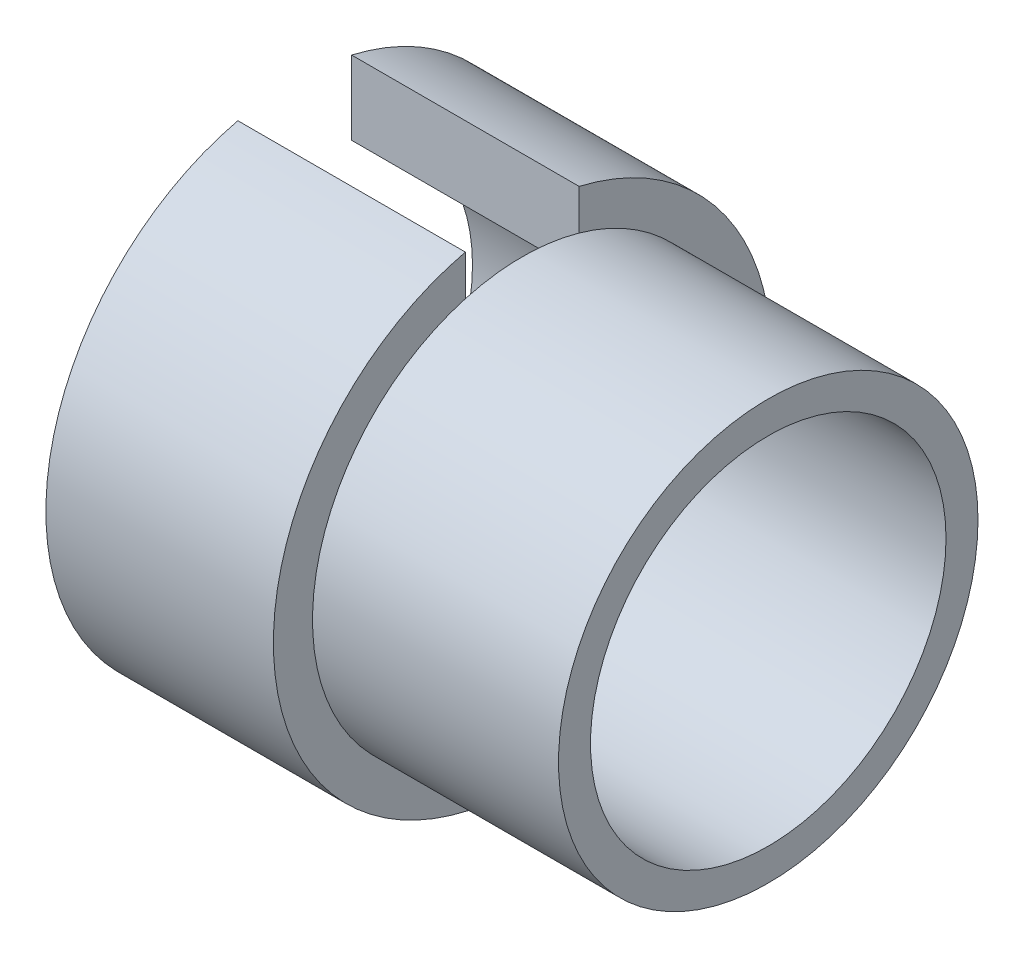
ISO-10303-21;
HEADER;
FILE_DESCRIPTION(('STEP AP214'),'2;1');
FILE_NAME('part.step','',(''),(''),'','','');
FILE_SCHEMA(('AUTOMOTIVE_DESIGN { 1 0 10303 214 1 1 1 1 }'));
ENDSEC;
DATA;
#1=APPLICATION_CONTEXT('core data for automotive mechanical design processes');
#2=APPLICATION_PROTOCOL_DEFINITION('international standard','automotive_design',2000,#1);
#3=PRODUCT_CONTEXT('',#1,'mechanical');
#4=PRODUCT('Part','Part','',(#3));
#5=PRODUCT_RELATED_PRODUCT_CATEGORY('part','',(#4));
#6=PRODUCT_DEFINITION_FORMATION('','',#4);
#7=PRODUCT_DEFINITION_CONTEXT('part definition',#1,'design');
#8=PRODUCT_DEFINITION('design','',#6,#7);
#9=PRODUCT_DEFINITION_SHAPE('','',#8);
#10=(LENGTH_UNIT() NAMED_UNIT(*) SI_UNIT(.MILLI.,.METRE.));
#11=(NAMED_UNIT(*) PLANE_ANGLE_UNIT() SI_UNIT($,.RADIAN.));
#12=(NAMED_UNIT(*) SI_UNIT($,.STERADIAN.) SOLID_ANGLE_UNIT());
#13=UNCERTAINTY_MEASURE_WITH_UNIT(LENGTH_MEASURE(1.E-05),#10,'distance_accuracy_value','');
#14=(GEOMETRIC_REPRESENTATION_CONTEXT(3) GLOBAL_UNCERTAINTY_ASSIGNED_CONTEXT((#13)) GLOBAL_UNIT_ASSIGNED_CONTEXT((#10,
#11,#12)) REPRESENTATION_CONTEXT('',''));
#15=CARTESIAN_POINT('',(0.,0.,0.));
#16=DIRECTION('',(0.,0.,1.));
#17=DIRECTION('',(1.,0.,0.));
#18=AXIS2_PLACEMENT_3D('',#15,#16,#17);
#19=CARTESIAN_POINT('',(-122.602643770449,-155.807573628499,0.));
#20=DIRECTION('',(1.,0.,0.));
#21=DIRECTION('',(0.,0.,-1.));
#22=AXIS2_PLACEMENT_3D('',#19,#20,#21);
#23=CYLINDRICAL_SURFACE('',#22,14.7500000000002);
#24=CARTESIAN_POINT('',(-133.35,-155.807573628499,0.));
#25=DIRECTION('',(1.,0.,0.));
#26=DIRECTION('',(0.,0.,-1.));
#27=AXIS2_PLACEMENT_3D('',#24,#25,#26);
#28=CIRCLE('',#27,14.7500000000002);
#29=CARTESIAN_POINT('',(-133.35,-141.610302763998,-4.));
#30=VERTEX_POINT('',#29);
#31=CARTESIAN_POINT('',(-133.35,-141.610302763998,4.));
#32=VERTEX_POINT('',#31);
#33=EDGE_CURVE('E104',#30,#32,#28,.T.);
#34=ORIENTED_EDGE('',*,*,#33,.T.);
#35=EDGE_CURVE('E124',#32,#30,#28,.T.);
#36=ORIENTED_EDGE('',*,*,#35,.T.);
#37=EDGE_LOOP('',(#34,#36));
#38=FACE_BOUND('',#37,.T.);
#39=CARTESIAN_POINT('',(-116.05,-155.807573628499,0.));
#40=DIRECTION('',(1.,0.,0.));
#41=DIRECTION('',(0.,0.,-1.));
#42=AXIS2_PLACEMENT_3D('',#39,#40,#41);
#43=CIRCLE('',#42,14.7500000000002);
#44=CARTESIAN_POINT('',(-116.05,-155.807573628499,-14.7500000000002));
#45=VERTEX_POINT('',#44);
#46=EDGE_CURVE('E41',#45,#45,#43,.T.);
#47=ORIENTED_EDGE('',*,*,#46,.F.);
#48=EDGE_LOOP('',(#47));
#49=FACE_BOUND('',#48,.T.);
#50=ADVANCED_FACE('F34',(#38,#49),#23,.T.);
#51=CARTESIAN_POINT('',(-116.05,-141.057573628498,0.));
#52=DIRECTION('',(1.,0.,0.));
#53=DIRECTION('',(0.,0.,-1.));
#54=AXIS2_PLACEMENT_3D('',#51,#52,#53);
#55=PLANE('',#54);
#56=ORIENTED_EDGE('',*,*,#46,.T.);
#57=EDGE_LOOP('',(#56));
#58=FACE_BOUND('',#57,.T.);
#59=CARTESIAN_POINT('',(-116.05,-155.807573628499,0.));
#60=DIRECTION('',(1.,0.,0.));
#61=DIRECTION('',(0.,0.,-1.));
#62=AXIS2_PLACEMENT_3D('',#59,#60,#61);
#63=CIRCLE('',#62,12.5);
#64=CARTESIAN_POINT('',(-116.05,-155.807573628499,-12.5));
#65=VERTEX_POINT('',#64);
#66=EDGE_CURVE('E102',#65,#65,#63,.T.);
#67=ORIENTED_EDGE('',*,*,#66,.F.);
#68=EDGE_LOOP('',(#67));
#69=FACE_BOUND('',#68,.T.);
#70=ADVANCED_FACE('F112',(#58,#69),#55,.T.);
#71=CARTESIAN_POINT('',(-122.602643770449,-155.807573628499,0.));
#72=DIRECTION('',(1.,0.,0.));
#73=DIRECTION('',(0.,0.,-1.));
#74=AXIS2_PLACEMENT_3D('',#71,#72,#73);
#75=CYLINDRICAL_SURFACE('',#74,12.5);
#76=DIRECTION('',(1.,0.,0.));
#77=VECTOR('',#76,1.);
#78=CARTESIAN_POINT('',(-122.602643770449,-143.964854346172,-4.));
#79=LINE('',#78,#77);
#80=CARTESIAN_POINT('',(-149.35,-143.964854346172,-4.));
#81=VERTEX_POINT('',#80);
#82=CARTESIAN_POINT('',(-133.35,-143.964854346172,-4.));
#83=VERTEX_POINT('',#82);
#84=EDGE_CURVE('E132',#81,#83,#79,.T.);
#85=ORIENTED_EDGE('',*,*,#84,.F.);
#86=CARTESIAN_POINT('',(-149.35,-155.807573628499,0.));
#87=DIRECTION('',(1.,0.,0.));
#88=DIRECTION('',(0.,0.,-1.));
#89=AXIS2_PLACEMENT_3D('',#86,#87,#88);
#90=CIRCLE('',#89,12.5);
#91=CARTESIAN_POINT('',(-149.35,-143.964854346172,4.));
#92=VERTEX_POINT('',#91);
#93=EDGE_CURVE('E100',#92,#81,#90,.T.);
#94=ORIENTED_EDGE('',*,*,#93,.F.);
#95=DIRECTION('',(1.,0.,0.));
#96=VECTOR('',#95,1.);
#97=CARTESIAN_POINT('',(-122.602643770449,-143.964854346172,4.));
#98=LINE('',#97,#96);
#99=CARTESIAN_POINT('',(-133.35,-143.964854346172,4.));
#100=VERTEX_POINT('',#99);
#101=EDGE_CURVE('E81',#100,#92,#98,.F.);
#102=ORIENTED_EDGE('',*,*,#101,.F.);
#103=CARTESIAN_POINT('',(-133.35,-155.807573628499,0.));
#104=DIRECTION('',(1.,0.,0.));
#105=DIRECTION('',(0.,0.,-1.));
#106=AXIS2_PLACEMENT_3D('',#103,#104,#105);
#107=CIRCLE('',#106,12.5);
#108=EDGE_CURVE('E129',#83,#100,#107,.T.);
#109=ORIENTED_EDGE('',*,*,#108,.F.);
#110=EDGE_LOOP('',(#85,#94,#102,#109));
#111=FACE_BOUND('',#110,.T.);
#112=ORIENTED_EDGE('',*,*,#66,.T.);
#113=EDGE_LOOP('',(#112));
#114=FACE_BOUND('',#113,.T.);
#115=ADVANCED_FACE('F120',(#111,#114),#75,.F.);
#116=CARTESIAN_POINT('',(-149.35,-143.307573628499,0.));
#117=DIRECTION('',(-1.,0.,0.));
#118=DIRECTION('',(0.,0.,1.));
#119=AXIS2_PLACEMENT_3D('',#116,#117,#118);
#120=PLANE('',#119);
#121=DIRECTION('',(0.,-1.,0.));
#122=VECTOR('',#121,1.);
#123=CARTESIAN_POINT('',(-149.35,-138.770848591098,-4.));
#124=LINE('',#123,#122);
#125=CARTESIAN_POINT('',(-149.35,-138.770848591098,-4.));
#126=VERTEX_POINT('',#125);
#127=EDGE_CURVE('E55',#126,#81,#124,.T.);
#128=ORIENTED_EDGE('',*,*,#127,.F.);
#129=CARTESIAN_POINT('',(-149.35,-155.807573628499,0.));
#130=DIRECTION('',(1.,0.,0.));
#131=DIRECTION('',(0.,0.,-1.));
#132=AXIS2_PLACEMENT_3D('',#129,#130,#131);
#133=CIRCLE('',#132,17.5);
#134=CARTESIAN_POINT('',(-149.35,-138.770848591098,4.));
#135=VERTEX_POINT('',#134);
#136=EDGE_CURVE('E93',#135,#126,#133,.T.);
#137=ORIENTED_EDGE('',*,*,#136,.F.);
#138=DIRECTION('',(0.,1.,0.));
#139=VECTOR('',#138,1.);
#140=CARTESIAN_POINT('',(-149.35,-147.307573628499,4.));
#141=LINE('',#140,#139);
#142=EDGE_CURVE('E77',#92,#135,#141,.T.);
#143=ORIENTED_EDGE('',*,*,#142,.F.);
#144=ORIENTED_EDGE('',*,*,#93,.T.);
#145=EDGE_LOOP('',(#128,#137,#143,#144));
#146=FACE_BOUND('',#145,.T.);
#147=ADVANCED_FACE('F99',(#146),#120,.T.);
#148=CARTESIAN_POINT('',(-122.602643770449,-155.807573628499,0.));
#149=DIRECTION('',(1.,0.,0.));
#150=DIRECTION('',(0.,0.,-1.));
#151=AXIS2_PLACEMENT_3D('',#148,#149,#150);
#152=CYLINDRICAL_SURFACE('',#151,17.5);
#153=DIRECTION('',(-1.,0.,0.));
#154=VECTOR('',#153,1.);
#155=CARTESIAN_POINT('',(-121.308405421208,-138.770848591098,-4.));
#156=LINE('',#155,#154);
#157=CARTESIAN_POINT('',(-133.35,-138.770848591098,-4.));
#158=VERTEX_POINT('',#157);
#159=EDGE_CURVE('E96',#158,#126,#156,.T.);
#160=ORIENTED_EDGE('',*,*,#159,.F.);
#161=CARTESIAN_POINT('',(-133.35,-155.807573628499,0.));
#162=DIRECTION('',(1.,0.,0.));
#163=DIRECTION('',(0.,0.,-1.));
#164=AXIS2_PLACEMENT_3D('',#161,#162,#163);
#165=CIRCLE('',#164,17.5);
#166=CARTESIAN_POINT('',(-133.35,-138.770848591098,4.));
#167=VERTEX_POINT('',#166);
#168=EDGE_CURVE('E95',#167,#158,#165,.T.);
#169=ORIENTED_EDGE('',*,*,#168,.F.);
#170=DIRECTION('',(-1.,0.,0.));
#171=VECTOR('',#170,1.);
#172=CARTESIAN_POINT('',(-121.308405421208,-138.770848591098,4.));
#173=LINE('',#172,#171);
#174=EDGE_CURVE('E47',#167,#135,#173,.T.);
#175=ORIENTED_EDGE('',*,*,#174,.T.);
#176=ORIENTED_EDGE('',*,*,#136,.T.);
#177=EDGE_LOOP('',(#160,#169,#175,#176));
#178=FACE_BOUND('',#177,.T.);
#179=ADVANCED_FACE('F92',(#178),#152,.T.);
#180=CARTESIAN_POINT('',(-133.35,-138.307573628499,0.));
#181=DIRECTION('',(1.,0.,0.));
#182=DIRECTION('',(0.,0.,-1.));
#183=AXIS2_PLACEMENT_3D('',#180,#181,#182);
#184=PLANE('',#183);
#185=DIRECTION('',(0.,-1.,0.));
#186=VECTOR('',#185,1.);
#187=CARTESIAN_POINT('',(-133.35,-138.770848591098,-4.));
#188=LINE('',#187,#186);
#189=EDGE_CURVE('E137',#158,#30,#188,.T.);
#190=ORIENTED_EDGE('',*,*,#189,.T.);
#191=ORIENTED_EDGE('',*,*,#35,.F.);
#192=DIRECTION('',(0.,-1.,0.));
#193=VECTOR('',#192,1.);
#194=CARTESIAN_POINT('',(-133.35,-138.307573628499,4.));
#195=LINE('',#194,#193);
#196=EDGE_CURVE('E11',#167,#32,#195,.T.);
#197=ORIENTED_EDGE('',*,*,#196,.F.);
#198=ORIENTED_EDGE('',*,*,#168,.T.);
#199=EDGE_LOOP('',(#190,#191,#197,#198));
#200=FACE_BOUND('',#199,.T.);
#201=ADVANCED_FACE('F153',(#200),#184,.T.);
#202=CARTESIAN_POINT('',(-133.35,-138.307573628499,0.));
#203=DIRECTION('',(1.,0.,0.));
#204=DIRECTION('',(0.,0.,-1.));
#205=AXIS2_PLACEMENT_3D('',#202,#203,#204);
#206=PLANE('',#205);
#207=ORIENTED_EDGE('',*,*,#33,.F.);
#208=EDGE_CURVE('E86',#30,#83,#188,.T.);
#209=ORIENTED_EDGE('',*,*,#208,.T.);
#210=ORIENTED_EDGE('',*,*,#108,.T.);
#211=DIRECTION('',(0.,1.,0.));
#212=VECTOR('',#211,1.);
#213=CARTESIAN_POINT('',(-133.35,-147.307573628499,4.));
#214=LINE('',#213,#212);
#215=EDGE_CURVE('E97',#100,#32,#214,.T.);
#216=ORIENTED_EDGE('',*,*,#215,.T.);
#217=EDGE_LOOP('',(#207,#209,#210,#216));
#218=FACE_BOUND('',#217,.T.);
#219=ADVANCED_FACE('F142',(#218),#206,.F.);
#220=CARTESIAN_POINT('',(-121.308405421208,-138.770848591098,-4.));
#221=DIRECTION('',(0.,0.,-1.));
#222=DIRECTION('',(0.,1.,0.));
#223=AXIS2_PLACEMENT_3D('',#220,#221,#222);
#224=PLANE('',#223);
#225=ORIENTED_EDGE('',*,*,#84,.T.);
#226=ORIENTED_EDGE('',*,*,#208,.F.);
#227=ORIENTED_EDGE('',*,*,#189,.F.);
#228=ORIENTED_EDGE('',*,*,#159,.T.);
#229=ORIENTED_EDGE('',*,*,#127,.T.);
#230=EDGE_LOOP('',(#225,#226,#227,#228,#229));
#231=FACE_BOUND('',#230,.T.);
#232=ADVANCED_FACE('F145',(#231),#224,.F.);
#233=CARTESIAN_POINT('',(-121.308405421208,-147.307573628499,4.));
#234=DIRECTION('',(0.,0.,1.));
#235=DIRECTION('',(1.,0.,0.));
#236=AXIS2_PLACEMENT_3D('',#233,#234,#235);
#237=PLANE('',#236);
#238=ORIENTED_EDGE('',*,*,#101,.T.);
#239=ORIENTED_EDGE('',*,*,#142,.T.);
#240=ORIENTED_EDGE('',*,*,#174,.F.);
#241=ORIENTED_EDGE('',*,*,#196,.T.);
#242=ORIENTED_EDGE('',*,*,#215,.F.);
#243=EDGE_LOOP('',(#238,#239,#240,#241,#242));
#244=FACE_BOUND('',#243,.T.);
#245=ADVANCED_FACE('F78',(#244),#237,.F.);
#246=CLOSED_SHELL('',(#50,#70,#115,#147,#179,#201,#219,#232,#245));
#247=MANIFOLD_SOLID_BREP('B2',#246);
#248=ADVANCED_BREP_SHAPE_REPRESENTATION('',(#18,#247),#14);
#249=SHAPE_DEFINITION_REPRESENTATION(#9,#248);
ENDSEC;
END-ISO-10303-21;
